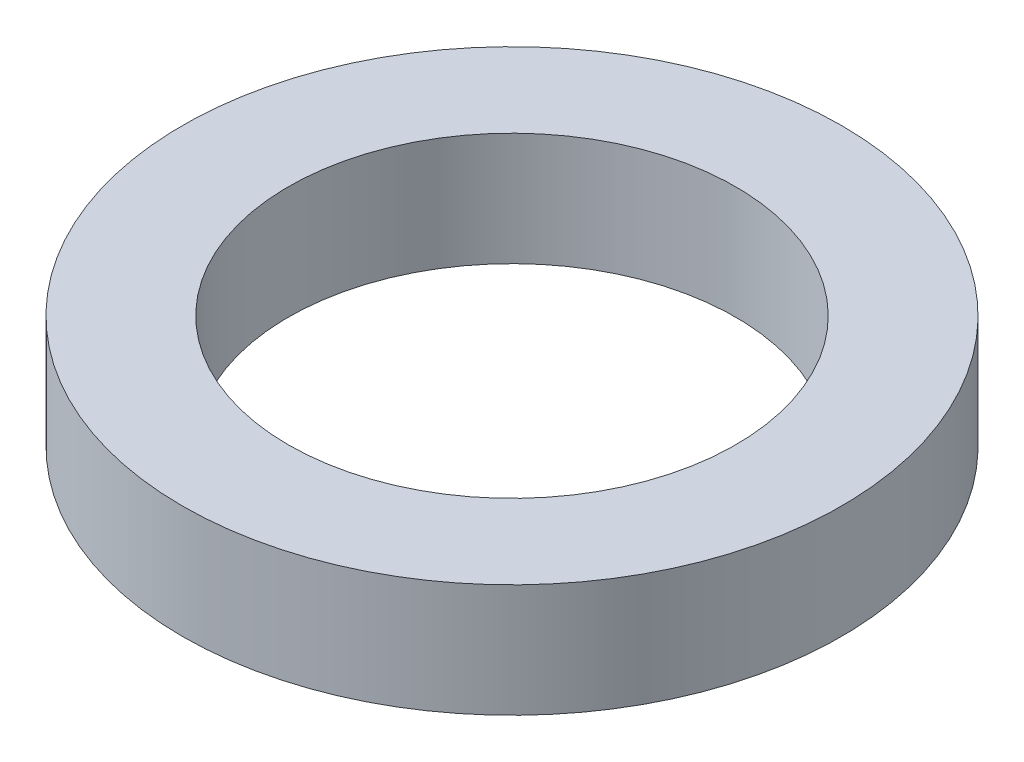
ISO-10303-21;
HEADER;
FILE_DESCRIPTION(('STEP AP214'),'2;1');
FILE_NAME('part.step','',(''),(''),'','','');
FILE_SCHEMA(('AUTOMOTIVE_DESIGN { 1 0 10303 214 1 1 1 1 }'));
ENDSEC;
DATA;
#1=APPLICATION_CONTEXT('core data for automotive mechanical design processes');
#2=APPLICATION_PROTOCOL_DEFINITION('international standard','automotive_design',2000,#1);
#3=PRODUCT_CONTEXT('',#1,'mechanical');
#4=PRODUCT('Part','Part','',(#3));
#5=PRODUCT_RELATED_PRODUCT_CATEGORY('part','',(#4));
#6=PRODUCT_DEFINITION_FORMATION('','',#4);
#7=PRODUCT_DEFINITION_CONTEXT('part definition',#1,'design');
#8=PRODUCT_DEFINITION('design','',#6,#7);
#9=PRODUCT_DEFINITION_SHAPE('','',#8);
#10=(LENGTH_UNIT() NAMED_UNIT(*) SI_UNIT(.MILLI.,.METRE.));
#11=(NAMED_UNIT(*) PLANE_ANGLE_UNIT() SI_UNIT($,.RADIAN.));
#12=(NAMED_UNIT(*) SI_UNIT($,.STERADIAN.) SOLID_ANGLE_UNIT());
#13=UNCERTAINTY_MEASURE_WITH_UNIT(LENGTH_MEASURE(1.E-05),#10,'distance_accuracy_value','');
#14=(GEOMETRIC_REPRESENTATION_CONTEXT(3) GLOBAL_UNCERTAINTY_ASSIGNED_CONTEXT((#13)) GLOBAL_UNIT_ASSIGNED_CONTEXT((#10,
#11,#12)) REPRESENTATION_CONTEXT('',''));
#15=CARTESIAN_POINT('',(0.,0.,0.));
#16=DIRECTION('',(0.,0.,1.));
#17=DIRECTION('',(1.,0.,0.));
#18=AXIS2_PLACEMENT_3D('',#15,#16,#17);
#19=CARTESIAN_POINT('',(0.,24.,0.));
#20=DIRECTION('',(0.,-1.,0.));
#21=DIRECTION('',(0.,0.,-1.));
#22=AXIS2_PLACEMENT_3D('',#19,#20,#21);
#23=CYLINDRICAL_SURFACE('',#22,70.);
#24=CARTESIAN_POINT('',(0.,24.,0.));
#25=DIRECTION('',(0.,1.,0.));
#26=DIRECTION('',(0.,0.,1.));
#27=AXIS2_PLACEMENT_3D('',#24,#25,#26);
#28=CIRCLE('',#27,70.);
#29=CARTESIAN_POINT('',(0.,24.,70.));
#30=VERTEX_POINT('',#29);
#31=EDGE_CURVE('E10',#30,#30,#28,.T.);
#32=ORIENTED_EDGE('',*,*,#31,.F.);
#33=EDGE_LOOP('',(#32));
#34=FACE_BOUND('',#33,.T.);
#35=CARTESIAN_POINT('',(0.,0.,0.));
#36=DIRECTION('',(0.,1.,0.));
#37=DIRECTION('',(0.,0.,1.));
#38=AXIS2_PLACEMENT_3D('',#35,#36,#37);
#39=CIRCLE('',#38,70.);
#40=CARTESIAN_POINT('',(0.,0.,70.));
#41=VERTEX_POINT('',#40);
#42=EDGE_CURVE('E37',#41,#41,#39,.T.);
#43=ORIENTED_EDGE('',*,*,#42,.T.);
#44=EDGE_LOOP('',(#43));
#45=FACE_BOUND('',#44,.T.);
#46=ADVANCED_FACE('F40',(#34,#45),#23,.T.);
#47=CARTESIAN_POINT('',(0.,24.,0.));
#48=DIRECTION('',(0.,1.,0.));
#49=DIRECTION('',(0.,0.,1.));
#50=AXIS2_PLACEMENT_3D('',#47,#48,#49);
#51=PLANE('',#50);
#52=CARTESIAN_POINT('',(0.,24.,0.));
#53=DIRECTION('',(0.,1.,0.));
#54=DIRECTION('',(0.,0.,1.));
#55=AXIS2_PLACEMENT_3D('',#52,#53,#54);
#56=CIRCLE('',#55,47.5);
#57=CARTESIAN_POINT('',(0.,24.,47.5));
#58=VERTEX_POINT('',#57);
#59=EDGE_CURVE('E50',#58,#58,#56,.T.);
#60=ORIENTED_EDGE('',*,*,#59,.F.);
#61=EDGE_LOOP('',(#60));
#62=FACE_BOUND('',#61,.T.);
#63=ORIENTED_EDGE('',*,*,#31,.T.);
#64=EDGE_LOOP('',(#63));
#65=FACE_BOUND('',#64,.T.);
#66=ADVANCED_FACE('F59',(#62,#65),#51,.T.);
#67=CARTESIAN_POINT('',(0.,0.,0.));
#68=DIRECTION('',(0.,1.,0.));
#69=DIRECTION('',(0.,0.,1.));
#70=AXIS2_PLACEMENT_3D('',#67,#68,#69);
#71=PLANE('',#70);
#72=CARTESIAN_POINT('',(0.,0.,0.));
#73=DIRECTION('',(0.,1.,0.));
#74=DIRECTION('',(0.,0.,1.));
#75=AXIS2_PLACEMENT_3D('',#72,#73,#74);
#76=CIRCLE('',#75,47.5);
#77=CARTESIAN_POINT('',(0.,0.,47.5));
#78=VERTEX_POINT('',#77);
#79=EDGE_CURVE('E47',#78,#78,#76,.T.);
#80=ORIENTED_EDGE('',*,*,#79,.T.);
#81=EDGE_LOOP('',(#80));
#82=FACE_BOUND('',#81,.T.);
#83=ORIENTED_EDGE('',*,*,#42,.F.);
#84=EDGE_LOOP('',(#83));
#85=FACE_BOUND('',#84,.T.);
#86=ADVANCED_FACE('F58',(#82,#85),#71,.F.);
#87=CARTESIAN_POINT('',(0.,24.,0.));
#88=DIRECTION('',(0.,-1.,0.));
#89=DIRECTION('',(0.,0.,-1.));
#90=AXIS2_PLACEMENT_3D('',#87,#88,#89);
#91=CYLINDRICAL_SURFACE('',#90,47.5);
#92=ORIENTED_EDGE('',*,*,#59,.T.);
#93=EDGE_LOOP('',(#92));
#94=FACE_BOUND('',#93,.T.);
#95=ORIENTED_EDGE('',*,*,#79,.F.);
#96=EDGE_LOOP('',(#95));
#97=FACE_BOUND('',#96,.T.);
#98=ADVANCED_FACE('F54',(#94,#97),#91,.F.);
#99=CLOSED_SHELL('',(#46,#66,#86,#98));
#100=MANIFOLD_SOLID_BREP('B2',#99);
#101=ADVANCED_BREP_SHAPE_REPRESENTATION('',(#18,#100),#14);
#102=SHAPE_DEFINITION_REPRESENTATION(#9,#101);
ENDSEC;
END-ISO-10303-21;
